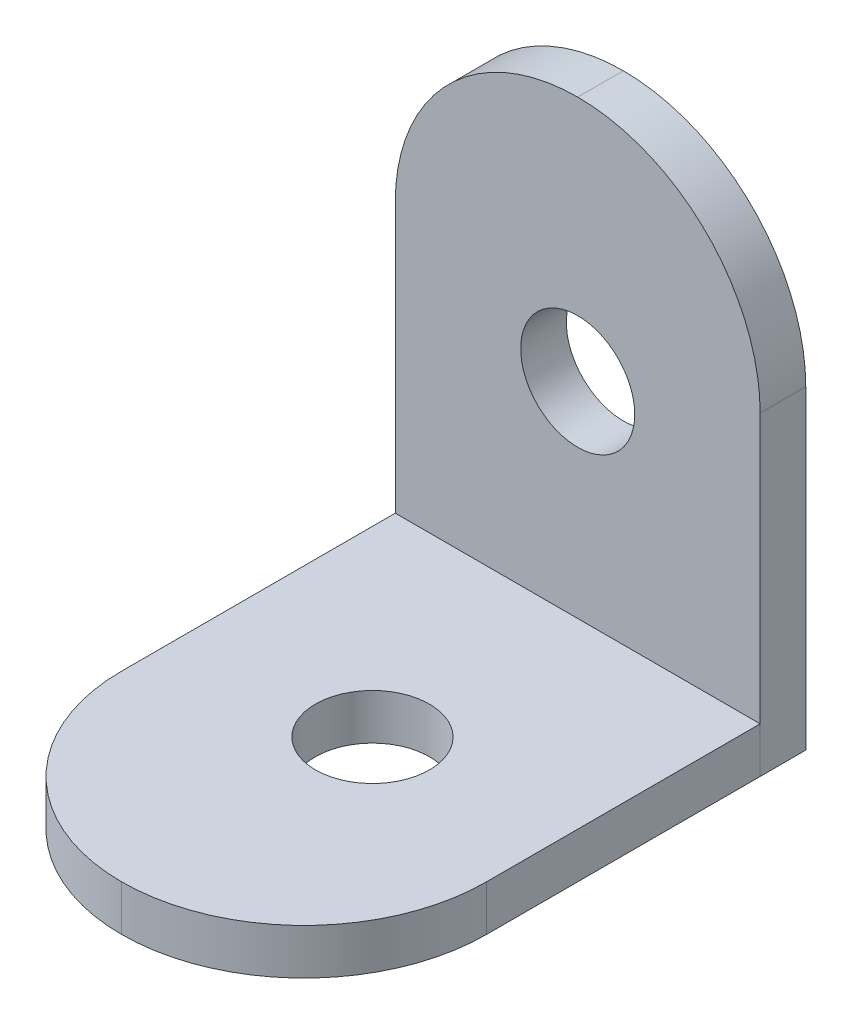
ISO-10303-21;
HEADER;
FILE_DESCRIPTION(('STEP AP214'),'2;1');
FILE_NAME('part.step','',(''),(''),'','','');
FILE_SCHEMA(('AUTOMOTIVE_DESIGN { 1 0 10303 214 1 1 1 1 }'));
ENDSEC;
DATA;
#1=APPLICATION_CONTEXT('core data for automotive mechanical design processes');
#2=APPLICATION_PROTOCOL_DEFINITION('international standard','automotive_design',2000,#1);
#3=PRODUCT_CONTEXT('',#1,'mechanical');
#4=PRODUCT('Part','Part','',(#3));
#5=PRODUCT_RELATED_PRODUCT_CATEGORY('part','',(#4));
#6=PRODUCT_DEFINITION_FORMATION('','',#4);
#7=PRODUCT_DEFINITION_CONTEXT('part definition',#1,'design');
#8=PRODUCT_DEFINITION('design','',#6,#7);
#9=PRODUCT_DEFINITION_SHAPE('','',#8);
#10=(LENGTH_UNIT() NAMED_UNIT(*) SI_UNIT(.MILLI.,.METRE.));
#11=(NAMED_UNIT(*) PLANE_ANGLE_UNIT() SI_UNIT($,.RADIAN.));
#12=(NAMED_UNIT(*) SI_UNIT($,.STERADIAN.) SOLID_ANGLE_UNIT());
#13=UNCERTAINTY_MEASURE_WITH_UNIT(LENGTH_MEASURE(1.E-05),#10,'distance_accuracy_value','');
#14=(GEOMETRIC_REPRESENTATION_CONTEXT(3) GLOBAL_UNCERTAINTY_ASSIGNED_CONTEXT((#13)) GLOBAL_UNIT_ASSIGNED_CONTEXT((#10,
#11,#12)) REPRESENTATION_CONTEXT('',''));
#15=CARTESIAN_POINT('',(0.,0.,0.));
#16=DIRECTION('',(0.,0.,1.));
#17=DIRECTION('',(1.,0.,0.));
#18=AXIS2_PLACEMENT_3D('',#15,#16,#17);
#19=CARTESIAN_POINT('',(0.,21.8,0.));
#20=DIRECTION('',(1.,0.,0.));
#21=DIRECTION('',(0.,0.,-1.));
#22=AXIS2_PLACEMENT_3D('',#19,#20,#21);
#23=PLANE('',#22);
#24=DIRECTION('',(0.,-1.,0.));
#25=VECTOR('',#24,1.);
#26=CARTESIAN_POINT('',(0.,21.8,0.));
#27=LINE('',#26,#25);
#28=CARTESIAN_POINT('',(0.,13.8,0.));
#29=VERTEX_POINT('',#28);
#30=CARTESIAN_POINT('',(0.,0.,0.));
#31=VERTEX_POINT('',#30);
#32=EDGE_CURVE('E91',#29,#31,#27,.T.);
#33=ORIENTED_EDGE('',*,*,#32,.F.);
#34=DIRECTION('',(0.,0.,1.));
#35=VECTOR('',#34,1.);
#36=CARTESIAN_POINT('',(0.,13.8,0.));
#37=LINE('',#36,#35);
#38=CARTESIAN_POINT('',(0.,13.8,-2.));
#39=VERTEX_POINT('',#38);
#40=EDGE_CURVE('E56',#29,#39,#37,.F.);
#41=ORIENTED_EDGE('',*,*,#40,.T.);
#42=DIRECTION('',(0.,-1.,0.));
#43=VECTOR('',#42,1.);
#44=CARTESIAN_POINT('',(0.,21.8,-2.));
#45=LINE('',#44,#43);
#46=CARTESIAN_POINT('',(0.,0.,-2.));
#47=VERTEX_POINT('',#46);
#48=EDGE_CURVE('E109',#39,#47,#45,.T.);
#49=ORIENTED_EDGE('',*,*,#48,.T.);
#50=DIRECTION('',(0.,0.,1.));
#51=VECTOR('',#50,1.);
#52=CARTESIAN_POINT('',(0.,0.,0.));
#53=LINE('',#52,#51);
#54=EDGE_CURVE('E105',#47,#31,#53,.T.);
#55=ORIENTED_EDGE('',*,*,#54,.T.);
#56=EDGE_LOOP('',(#33,#41,#49,#55));
#57=FACE_BOUND('',#56,.T.);
#58=ADVANCED_FACE('F47',(#57),#23,.F.);
#59=CARTESIAN_POINT('',(0.,21.8,0.));
#60=DIRECTION('',(0.,0.,-1.));
#61=DIRECTION('',(-1.,0.,0.));
#62=AXIS2_PLACEMENT_3D('',#59,#60,#61);
#63=PLANE('',#62);
#64=CARTESIAN_POINT('',(8.,11.,0.));
#65=DIRECTION('',(0.,0.,1.));
#66=DIRECTION('',(1.,0.,0.));
#67=AXIS2_PLACEMENT_3D('',#64,#65,#66);
#68=CIRCLE('',#67,2.5);
#69=CARTESIAN_POINT('',(10.5,11.,0.));
#70=VERTEX_POINT('',#69);
#71=EDGE_CURVE('E113',#70,#70,#68,.T.);
#72=ORIENTED_EDGE('',*,*,#71,.F.);
#73=EDGE_LOOP('',(#72));
#74=FACE_BOUND('',#73,.T.);
#75=CARTESIAN_POINT('',(8.,13.8,0.));
#76=DIRECTION('',(0.,0.,-1.));
#77=DIRECTION('',(-1.,0.,0.));
#78=AXIS2_PLACEMENT_3D('',#75,#76,#77);
#79=CIRCLE('',#78,8.);
#80=CARTESIAN_POINT('',(16.,13.8,0.));
#81=VERTEX_POINT('',#80);
#82=CARTESIAN_POINT('',(8.,21.8,0.));
#83=VERTEX_POINT('',#82);
#84=EDGE_CURVE('E129',#81,#83,#79,.F.);
#85=ORIENTED_EDGE('',*,*,#84,.T.);
#86=CARTESIAN_POINT('',(8.,13.8,0.));
#87=DIRECTION('',(0.,0.,-1.));
#88=DIRECTION('',(-1.,0.,0.));
#89=AXIS2_PLACEMENT_3D('',#86,#87,#88);
#90=CIRCLE('',#89,8.);
#91=EDGE_CURVE('E70',#83,#29,#90,.F.);
#92=ORIENTED_EDGE('',*,*,#91,.T.);
#93=ORIENTED_EDGE('',*,*,#32,.T.);
#94=DIRECTION('',(1.,0.,0.));
#95=VECTOR('',#94,1.);
#96=CARTESIAN_POINT('',(0.,0.,0.));
#97=LINE('',#96,#95);
#98=CARTESIAN_POINT('',(16.,0.,0.));
#99=VERTEX_POINT('',#98);
#100=EDGE_CURVE('E95',#31,#99,#97,.T.);
#101=ORIENTED_EDGE('',*,*,#100,.T.);
#102=DIRECTION('',(0.,-1.,0.));
#103=VECTOR('',#102,1.);
#104=CARTESIAN_POINT('',(16.,21.8,0.));
#105=LINE('',#104,#103);
#106=EDGE_CURVE('E99',#81,#99,#105,.T.);
#107=ORIENTED_EDGE('',*,*,#106,.F.);
#108=EDGE_LOOP('',(#85,#92,#93,#101,#107));
#109=FACE_BOUND('',#108,.T.);
#110=ADVANCED_FACE('F93',(#74,#109),#63,.F.);
#111=CARTESIAN_POINT('',(16.,21.8,0.));
#112=DIRECTION('',(-1.,0.,0.));
#113=DIRECTION('',(0.,0.,1.));
#114=AXIS2_PLACEMENT_3D('',#111,#112,#113);
#115=PLANE('',#114);
#116=DIRECTION('',(0.,-1.,0.));
#117=VECTOR('',#116,1.);
#118=CARTESIAN_POINT('',(16.,21.8,-2.));
#119=LINE('',#118,#117);
#120=CARTESIAN_POINT('',(16.,13.8,-2.));
#121=VERTEX_POINT('',#120);
#122=CARTESIAN_POINT('',(16.,0.,-2.));
#123=VERTEX_POINT('',#122);
#124=EDGE_CURVE('E120',#121,#123,#119,.T.);
#125=ORIENTED_EDGE('',*,*,#124,.F.);
#126=DIRECTION('',(0.,0.,-1.));
#127=VECTOR('',#126,1.);
#128=CARTESIAN_POINT('',(16.,13.8,0.));
#129=LINE('',#128,#127);
#130=EDGE_CURVE('E127',#121,#81,#129,.F.);
#131=ORIENTED_EDGE('',*,*,#130,.T.);
#132=ORIENTED_EDGE('',*,*,#106,.T.);
#133=DIRECTION('',(0.,0.,-1.));
#134=VECTOR('',#133,1.);
#135=CARTESIAN_POINT('',(16.,0.,0.));
#136=LINE('',#135,#134);
#137=EDGE_CURVE('E107',#99,#123,#136,.T.);
#138=ORIENTED_EDGE('',*,*,#137,.T.);
#139=EDGE_LOOP('',(#125,#131,#132,#138));
#140=FACE_BOUND('',#139,.T.);
#141=ADVANCED_FACE('F144',(#140),#115,.F.);
#142=CARTESIAN_POINT('',(0.,21.8,-2.));
#143=DIRECTION('',(0.,0.,1.));
#144=DIRECTION('',(1.,0.,0.));
#145=AXIS2_PLACEMENT_3D('',#142,#143,#144);
#146=PLANE('',#145);
#147=CARTESIAN_POINT('',(8.,11.,-2.));
#148=DIRECTION('',(0.,0.,1.));
#149=DIRECTION('',(1.,0.,0.));
#150=AXIS2_PLACEMENT_3D('',#147,#148,#149);
#151=CIRCLE('',#150,2.5);
#152=CARTESIAN_POINT('',(10.5,11.,-2.));
#153=VERTEX_POINT('',#152);
#154=EDGE_CURVE('E51',#153,#153,#151,.T.);
#155=ORIENTED_EDGE('',*,*,#154,.T.);
#156=EDGE_LOOP('',(#155));
#157=FACE_BOUND('',#156,.T.);
#158=ORIENTED_EDGE('',*,*,#48,.F.);
#159=CARTESIAN_POINT('',(8.,13.8,-2.));
#160=DIRECTION('',(0.,0.,1.));
#161=DIRECTION('',(1.,0.,0.));
#162=AXIS2_PLACEMENT_3D('',#159,#160,#161);
#163=CIRCLE('',#162,8.);
#164=CARTESIAN_POINT('',(8.,21.8,-2.));
#165=VERTEX_POINT('',#164);
#166=EDGE_CURVE('E12',#39,#165,#163,.F.);
#167=ORIENTED_EDGE('',*,*,#166,.T.);
#168=CARTESIAN_POINT('',(8.,13.8,-2.));
#169=DIRECTION('',(0.,0.,1.));
#170=DIRECTION('',(1.,0.,0.));
#171=AXIS2_PLACEMENT_3D('',#168,#169,#170);
#172=CIRCLE('',#171,8.);
#173=EDGE_CURVE('E125',#165,#121,#172,.F.);
#174=ORIENTED_EDGE('',*,*,#173,.T.);
#175=ORIENTED_EDGE('',*,*,#124,.T.);
#176=DIRECTION('',(-1.,0.,0.));
#177=VECTOR('',#176,1.);
#178=CARTESIAN_POINT('',(0.,0.,-2.));
#179=LINE('',#178,#177);
#180=EDGE_CURVE('E117',#123,#47,#179,.T.);
#181=ORIENTED_EDGE('',*,*,#180,.T.);
#182=EDGE_LOOP('',(#158,#167,#174,#175,#181));
#183=FACE_BOUND('',#182,.T.);
#184=ADVANCED_FACE('F141',(#157,#183),#146,.F.);
#185=CARTESIAN_POINT('',(0.,0.,0.));
#186=DIRECTION('',(0.,-1.,0.));
#187=DIRECTION('',(0.,0.,-1.));
#188=AXIS2_PLACEMENT_3D('',#185,#186,#187);
#189=PLANE('',#188);
#190=ORIENTED_EDGE('',*,*,#54,.F.);
#191=ORIENTED_EDGE('',*,*,#180,.F.);
#192=ORIENTED_EDGE('',*,*,#137,.F.);
#193=ORIENTED_EDGE('',*,*,#100,.F.);
#194=EDGE_LOOP('',(#190,#191,#192,#193));
#195=FACE_BOUND('',#194,.T.);
#196=ADVANCED_FACE('F103',(#195),#189,.T.);
#197=CARTESIAN_POINT('',(8.,13.8,0.));
#198=DIRECTION('',(0.,0.,-1.));
#199=DIRECTION('',(-1.,0.,0.));
#200=AXIS2_PLACEMENT_3D('',#197,#198,#199);
#201=CYLINDRICAL_SURFACE('',#200,8.);
#202=ORIENTED_EDGE('',*,*,#84,.F.);
#203=ORIENTED_EDGE('',*,*,#130,.F.);
#204=ORIENTED_EDGE('',*,*,#173,.F.);
#205=DIRECTION('',(0.,0.,-1.));
#206=VECTOR('',#205,1.);
#207=CARTESIAN_POINT('',(8.,21.8,0.));
#208=LINE('',#207,#206);
#209=EDGE_CURVE('E98',#83,#165,#208,.T.);
#210=ORIENTED_EDGE('',*,*,#209,.F.);
#211=EDGE_LOOP('',(#202,#203,#204,#210));
#212=FACE_BOUND('',#211,.T.);
#213=ADVANCED_FACE('F137',(#212),#201,.T.);
#214=CARTESIAN_POINT('',(8.,13.8,0.));
#215=DIRECTION('',(0.,0.,1.));
#216=DIRECTION('',(1.,0.,0.));
#217=AXIS2_PLACEMENT_3D('',#214,#215,#216);
#218=CYLINDRICAL_SURFACE('',#217,8.);
#219=ORIENTED_EDGE('',*,*,#166,.F.);
#220=ORIENTED_EDGE('',*,*,#40,.F.);
#221=ORIENTED_EDGE('',*,*,#91,.F.);
#222=ORIENTED_EDGE('',*,*,#209,.T.);
#223=EDGE_LOOP('',(#219,#220,#221,#222));
#224=FACE_BOUND('',#223,.T.);
#225=ADVANCED_FACE('F49',(#224),#218,.T.);
#226=CARTESIAN_POINT('',(8.,11.,-3.));
#227=DIRECTION('',(0.,0.,1.));
#228=DIRECTION('',(1.,0.,0.));
#229=AXIS2_PLACEMENT_3D('',#226,#227,#228);
#230=CYLINDRICAL_SURFACE('',#229,2.5);
#231=ORIENTED_EDGE('',*,*,#71,.T.);
#232=EDGE_LOOP('',(#231));
#233=FACE_BOUND('',#232,.T.);
#234=ORIENTED_EDGE('',*,*,#154,.F.);
#235=EDGE_LOOP('',(#234));
#236=FACE_BOUND('',#235,.T.);
#237=ADVANCED_FACE('F164',(#233,#236),#230,.F.);
#238=CLOSED_SHELL('',(#58,#110,#141,#184,#196,#213,#225,#237));
#239=MANIFOLD_SOLID_BREP('B2',#238);
#240=CARTESIAN_POINT('',(0.,0.,20.));
#241=DIRECTION('',(1.,0.,0.));
#242=DIRECTION('',(0.,0.,-1.));
#243=AXIS2_PLACEMENT_3D('',#240,#241,#242);
#244=PLANE('',#243);
#245=DIRECTION('',(0.,0.,-1.));
#246=VECTOR('',#245,1.);
#247=CARTESIAN_POINT('',(0.,0.,20.));
#248=LINE('',#247,#246);
#249=CARTESIAN_POINT('',(0.,0.,12.));
#250=VERTEX_POINT('',#249);
#251=CARTESIAN_POINT('',(0.,0.,0.));
#252=VERTEX_POINT('',#251);
#253=EDGE_CURVE('E263',#250,#252,#248,.T.);
#254=ORIENTED_EDGE('',*,*,#253,.F.);
#255=DIRECTION('',(0.,-1.,0.));
#256=VECTOR('',#255,1.);
#257=CARTESIAN_POINT('',(0.,0.,12.));
#258=LINE('',#257,#256);
#259=CARTESIAN_POINT('',(0.,2.,12.));
#260=VERTEX_POINT('',#259);
#261=EDGE_CURVE('E304',#250,#260,#258,.F.);
#262=ORIENTED_EDGE('',*,*,#261,.T.);
#263=DIRECTION('',(0.,0.,-1.));
#264=VECTOR('',#263,1.);
#265=CARTESIAN_POINT('',(0.,2.,20.));
#266=LINE('',#265,#264);
#267=CARTESIAN_POINT('',(0.,2.,0.));
#268=VERTEX_POINT('',#267);
#269=EDGE_CURVE('E285',#260,#268,#266,.T.);
#270=ORIENTED_EDGE('',*,*,#269,.T.);
#271=DIRECTION('',(0.,-1.,0.));
#272=VECTOR('',#271,1.);
#273=CARTESIAN_POINT('',(0.,0.,0.));
#274=LINE('',#273,#272);
#275=EDGE_CURVE('E280',#268,#252,#274,.T.);
#276=ORIENTED_EDGE('',*,*,#275,.T.);
#277=EDGE_LOOP('',(#254,#262,#270,#276));
#278=FACE_BOUND('',#277,.T.);
#279=ADVANCED_FACE('F218',(#278),#244,.F.);
#280=CARTESIAN_POINT('',(0.,0.,20.));
#281=DIRECTION('',(0.,1.,0.));
#282=DIRECTION('',(0.,0.,1.));
#283=AXIS2_PLACEMENT_3D('',#280,#281,#282);
#284=PLANE('',#283);
#285=CARTESIAN_POINT('',(8.,0.,9.));
#286=DIRECTION('',(0.,1.,0.));
#287=DIRECTION('',(0.,0.,1.));
#288=AXIS2_PLACEMENT_3D('',#285,#286,#287);
#289=CIRCLE('',#288,2.5);
#290=CARTESIAN_POINT('',(8.,0.,11.5));
#291=VERTEX_POINT('',#290);
#292=EDGE_CURVE('E287',#291,#291,#289,.T.);
#293=ORIENTED_EDGE('',*,*,#292,.T.);
#294=EDGE_LOOP('',(#293));
#295=FACE_BOUND('',#294,.T.);
#296=DIRECTION('',(0.,0.,-1.));
#297=VECTOR('',#296,1.);
#298=CARTESIAN_POINT('',(16.,0.,20.));
#299=LINE('',#298,#297);
#300=CARTESIAN_POINT('',(16.,0.,12.));
#301=VERTEX_POINT('',#300);
#302=CARTESIAN_POINT('',(16.,0.,0.));
#303=VERTEX_POINT('',#302);
#304=EDGE_CURVE('E274',#301,#303,#299,.T.);
#305=ORIENTED_EDGE('',*,*,#304,.F.);
#306=CARTESIAN_POINT('',(8.,0.,12.));
#307=DIRECTION('',(0.,1.,0.));
#308=DIRECTION('',(0.,0.,1.));
#309=AXIS2_PLACEMENT_3D('',#306,#307,#308);
#310=CIRCLE('',#309,8.);
#311=CARTESIAN_POINT('',(8.,0.,20.));
#312=VERTEX_POINT('',#311);
#313=EDGE_CURVE('E45',#301,#312,#310,.F.);
#314=ORIENTED_EDGE('',*,*,#313,.T.);
#315=CARTESIAN_POINT('',(8.,0.,12.));
#316=DIRECTION('',(0.,1.,0.));
#317=DIRECTION('',(0.,0.,1.));
#318=AXIS2_PLACEMENT_3D('',#315,#316,#317);
#319=CIRCLE('',#318,8.);
#320=EDGE_CURVE('E269',#312,#250,#319,.F.);
#321=ORIENTED_EDGE('',*,*,#320,.T.);
#322=ORIENTED_EDGE('',*,*,#253,.T.);
#323=DIRECTION('',(1.,0.,0.));
#324=VECTOR('',#323,1.);
#325=CARTESIAN_POINT('',(0.,0.,0.));
#326=LINE('',#325,#324);
#327=EDGE_CURVE('E266',#252,#303,#326,.T.);
#328=ORIENTED_EDGE('',*,*,#327,.T.);
#329=EDGE_LOOP('',(#305,#314,#321,#322,#328));
#330=FACE_BOUND('',#329,.T.);
#331=ADVANCED_FACE('F265',(#295,#330),#284,.F.);
#332=CARTESIAN_POINT('',(16.,0.,20.));
#333=DIRECTION('',(-1.,0.,0.));
#334=DIRECTION('',(0.,0.,1.));
#335=AXIS2_PLACEMENT_3D('',#332,#333,#334);
#336=PLANE('',#335);
#337=DIRECTION('',(0.,0.,-1.));
#338=VECTOR('',#337,1.);
#339=CARTESIAN_POINT('',(16.,2.,20.));
#340=LINE('',#339,#338);
#341=CARTESIAN_POINT('',(16.,2.,12.));
#342=VERTEX_POINT('',#341);
#343=CARTESIAN_POINT('',(16.,2.,0.));
#344=VERTEX_POINT('',#343);
#345=EDGE_CURVE('E298',#342,#344,#340,.T.);
#346=ORIENTED_EDGE('',*,*,#345,.F.);
#347=DIRECTION('',(0.,1.,0.));
#348=VECTOR('',#347,1.);
#349=CARTESIAN_POINT('',(16.,0.,12.));
#350=LINE('',#349,#348);
#351=EDGE_CURVE('E226',#342,#301,#350,.F.);
#352=ORIENTED_EDGE('',*,*,#351,.T.);
#353=ORIENTED_EDGE('',*,*,#304,.T.);
#354=DIRECTION('',(0.,1.,0.));
#355=VECTOR('',#354,1.);
#356=CARTESIAN_POINT('',(16.,0.,0.));
#357=LINE('',#356,#355);
#358=EDGE_CURVE('E282',#303,#344,#357,.T.);
#359=ORIENTED_EDGE('',*,*,#358,.T.);
#360=EDGE_LOOP('',(#346,#352,#353,#359));
#361=FACE_BOUND('',#360,.T.);
#362=ADVANCED_FACE('F315',(#361),#336,.F.);
#363=CARTESIAN_POINT('',(0.,2.,20.));
#364=DIRECTION('',(0.,-1.,0.));
#365=DIRECTION('',(0.,0.,-1.));
#366=AXIS2_PLACEMENT_3D('',#363,#364,#365);
#367=PLANE('',#366);
#368=CARTESIAN_POINT('',(8.,2.,9.));
#369=DIRECTION('',(0.,1.,0.));
#370=DIRECTION('',(0.,0.,1.));
#371=AXIS2_PLACEMENT_3D('',#368,#369,#370);
#372=CIRCLE('',#371,2.5);
#373=CARTESIAN_POINT('',(8.,2.,11.5));
#374=VERTEX_POINT('',#373);
#375=EDGE_CURVE('E290',#374,#374,#372,.T.);
#376=ORIENTED_EDGE('',*,*,#375,.F.);
#377=EDGE_LOOP('',(#376));
#378=FACE_BOUND('',#377,.T.);
#379=CARTESIAN_POINT('',(8.,2.,12.));
#380=DIRECTION('',(0.,-1.,0.));
#381=DIRECTION('',(0.,0.,-1.));
#382=AXIS2_PLACEMENT_3D('',#379,#380,#381);
#383=CIRCLE('',#382,8.);
#384=CARTESIAN_POINT('',(8.,2.,20.));
#385=VERTEX_POINT('',#384);
#386=EDGE_CURVE('E306',#260,#385,#383,.F.);
#387=ORIENTED_EDGE('',*,*,#386,.T.);
#388=CARTESIAN_POINT('',(8.,2.,12.));
#389=DIRECTION('',(0.,-1.,0.));
#390=DIRECTION('',(0.,0.,-1.));
#391=AXIS2_PLACEMENT_3D('',#388,#389,#390);
#392=CIRCLE('',#391,8.);
#393=EDGE_CURVE('E240',#385,#342,#392,.F.);
#394=ORIENTED_EDGE('',*,*,#393,.T.);
#395=ORIENTED_EDGE('',*,*,#345,.T.);
#396=DIRECTION('',(-1.,0.,0.));
#397=VECTOR('',#396,1.);
#398=CARTESIAN_POINT('',(0.,2.,0.));
#399=LINE('',#398,#397);
#400=EDGE_CURVE('E295',#344,#268,#399,.T.);
#401=ORIENTED_EDGE('',*,*,#400,.T.);
#402=ORIENTED_EDGE('',*,*,#269,.F.);
#403=EDGE_LOOP('',(#387,#394,#395,#401,#402));
#404=FACE_BOUND('',#403,.T.);
#405=ADVANCED_FACE('F310',(#378,#404),#367,.F.);
#406=CARTESIAN_POINT('',(0.,0.,0.));
#407=DIRECTION('',(0.,0.,-1.));
#408=DIRECTION('',(-1.,0.,0.));
#409=AXIS2_PLACEMENT_3D('',#406,#407,#408);
#410=PLANE('',#409);
#411=ORIENTED_EDGE('',*,*,#275,.F.);
#412=ORIENTED_EDGE('',*,*,#400,.F.);
#413=ORIENTED_EDGE('',*,*,#358,.F.);
#414=ORIENTED_EDGE('',*,*,#327,.F.);
#415=EDGE_LOOP('',(#411,#412,#413,#414));
#416=FACE_BOUND('',#415,.T.);
#417=ADVANCED_FACE('F278',(#416),#410,.T.);
#418=CARTESIAN_POINT('',(8.,0.,12.));
#419=DIRECTION('',(0.,-1.,0.));
#420=DIRECTION('',(0.,0.,-1.));
#421=AXIS2_PLACEMENT_3D('',#418,#419,#420);
#422=CYLINDRICAL_SURFACE('',#421,8.);
#423=ORIENTED_EDGE('',*,*,#386,.F.);
#424=ORIENTED_EDGE('',*,*,#261,.F.);
#425=ORIENTED_EDGE('',*,*,#320,.F.);
#426=DIRECTION('',(0.,-1.,0.));
#427=VECTOR('',#426,1.);
#428=CARTESIAN_POINT('',(8.,0.,20.));
#429=LINE('',#428,#427);
#430=EDGE_CURVE('E273',#385,#312,#429,.T.);
#431=ORIENTED_EDGE('',*,*,#430,.F.);
#432=EDGE_LOOP('',(#423,#424,#425,#431));
#433=FACE_BOUND('',#432,.T.);
#434=ADVANCED_FACE('F312',(#433),#422,.T.);
#435=CARTESIAN_POINT('',(8.,0.,12.));
#436=DIRECTION('',(0.,1.,0.));
#437=DIRECTION('',(0.,0.,1.));
#438=AXIS2_PLACEMENT_3D('',#435,#436,#437);
#439=CYLINDRICAL_SURFACE('',#438,8.);
#440=ORIENTED_EDGE('',*,*,#313,.F.);
#441=ORIENTED_EDGE('',*,*,#351,.F.);
#442=ORIENTED_EDGE('',*,*,#393,.F.);
#443=ORIENTED_EDGE('',*,*,#430,.T.);
#444=EDGE_LOOP('',(#440,#441,#442,#443));
#445=FACE_BOUND('',#444,.T.);
#446=ADVANCED_FACE('F220',(#445),#439,.T.);
#447=CARTESIAN_POINT('',(8.,0.,9.));
#448=DIRECTION('',(0.,1.,0.));
#449=DIRECTION('',(0.,0.,1.));
#450=AXIS2_PLACEMENT_3D('',#447,#448,#449);
#451=CYLINDRICAL_SURFACE('',#450,2.5);
#452=ORIENTED_EDGE('',*,*,#292,.F.);
#453=EDGE_LOOP('',(#452));
#454=FACE_BOUND('',#453,.T.);
#455=ORIENTED_EDGE('',*,*,#375,.T.);
#456=EDGE_LOOP('',(#455));
#457=FACE_BOUND('',#456,.T.);
#458=ADVANCED_FACE('F335',(#454,#457),#451,.F.);
#459=CLOSED_SHELL('',(#279,#331,#362,#405,#417,#434,#446,#458));
#460=MANIFOLD_SOLID_BREP('B6',#459);
#461=ADVANCED_BREP_SHAPE_REPRESENTATION('',(#18,#239,#460),#14);
#462=SHAPE_DEFINITION_REPRESENTATION(#9,#461);
ENDSEC;
END-ISO-10303-21;
